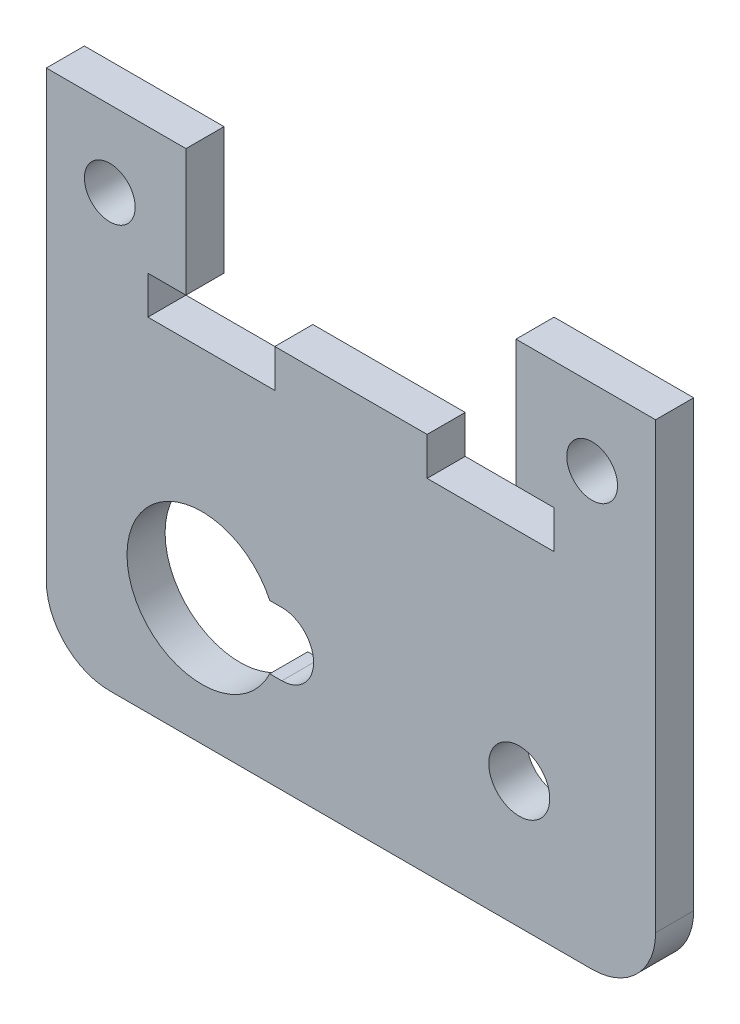
ISO-10303-21;
HEADER;
FILE_DESCRIPTION(('STEP AP214'),'2;1');
FILE_NAME('part.step','',(''),(''),'','','');
FILE_SCHEMA(('AUTOMOTIVE_DESIGN { 1 0 10303 214 1 1 1 1 }'));
ENDSEC;
DATA;
#1=APPLICATION_CONTEXT('core data for automotive mechanical design processes');
#2=APPLICATION_PROTOCOL_DEFINITION('international standard','automotive_design',2000,#1);
#3=PRODUCT_CONTEXT('',#1,'mechanical');
#4=PRODUCT('Part','Part','',(#3));
#5=PRODUCT_RELATED_PRODUCT_CATEGORY('part','',(#4));
#6=PRODUCT_DEFINITION_FORMATION('','',#4);
#7=PRODUCT_DEFINITION_CONTEXT('part definition',#1,'design');
#8=PRODUCT_DEFINITION('design','',#6,#7);
#9=PRODUCT_DEFINITION_SHAPE('','',#8);
#10=(LENGTH_UNIT() NAMED_UNIT(*) SI_UNIT(.MILLI.,.METRE.));
#11=(NAMED_UNIT(*) PLANE_ANGLE_UNIT() SI_UNIT($,.RADIAN.));
#12=(NAMED_UNIT(*) SI_UNIT($,.STERADIAN.) SOLID_ANGLE_UNIT());
#13=UNCERTAINTY_MEASURE_WITH_UNIT(LENGTH_MEASURE(1.E-05),#10,'distance_accuracy_value','');
#14=(GEOMETRIC_REPRESENTATION_CONTEXT(3) GLOBAL_UNCERTAINTY_ASSIGNED_CONTEXT((#13)) GLOBAL_UNIT_ASSIGNED_CONTEXT((#10,
#11,#12)) REPRESENTATION_CONTEXT('',''));
#15=CARTESIAN_POINT('',(0.,0.,0.));
#16=DIRECTION('',(0.,0.,1.));
#17=DIRECTION('',(1.,0.,0.));
#18=AXIS2_PLACEMENT_3D('',#15,#16,#17);
#19=CARTESIAN_POINT('',(103.12803142414,8.8100844335333,3.));
#20=DIRECTION('',(0.,0.,1.));
#21=DIRECTION('',(1.,0.,0.));
#22=AXIS2_PLACEMENT_3D('',#19,#20,#21);
#23=PLANE('',#22);
#24=CARTESIAN_POINT('',(65.1280314241405,37.8100844335333,3.));
#25=DIRECTION('',(0.,0.,1.));
#26=DIRECTION('',(1.,0.,0.));
#27=AXIS2_PLACEMENT_3D('',#24,#25,#26);
#28=CIRCLE('',#27,2.);
#29=CARTESIAN_POINT('',(67.1280314241405,37.8100844335333,3.));
#30=VERTEX_POINT('',#29);
#31=EDGE_CURVE('E224',#30,#30,#28,.T.);
#32=ORIENTED_EDGE('',*,*,#31,.F.);
#33=EDGE_LOOP('',(#32));
#34=FACE_BOUND('',#33,.T.);
#35=CARTESIAN_POINT('',(103.12803142414,8.8100844335333,3.));
#36=DIRECTION('',(0.,0.,1.));
#37=DIRECTION('',(1.,0.,0.));
#38=AXIS2_PLACEMENT_3D('',#35,#36,#37);
#39=CIRCLE('',#38,5.);
#40=CARTESIAN_POINT('',(103.12803142414,3.8100844335333,3.));
#41=VERTEX_POINT('',#40);
#42=CARTESIAN_POINT('',(108.12803142414,8.8100844335333,3.));
#43=VERTEX_POINT('',#42);
#44=EDGE_CURVE('E236',#41,#43,#39,.T.);
#45=ORIENTED_EDGE('',*,*,#44,.T.);
#46=DIRECTION('',(0.,1.,0.));
#47=VECTOR('',#46,1.);
#48=CARTESIAN_POINT('',(108.12803142414,8.8100844335333,3.));
#49=LINE('',#48,#47);
#50=CARTESIAN_POINT('',(108.12803142414,43.8100844335333,3.));
#51=VERTEX_POINT('',#50);
#52=EDGE_CURVE('E239',#43,#51,#49,.T.);
#53=ORIENTED_EDGE('',*,*,#52,.T.);
#54=DIRECTION('',(-1.,0.,0.));
#55=VECTOR('',#54,1.);
#56=CARTESIAN_POINT('',(108.12803142414,43.8100844335333,3.));
#57=LINE('',#56,#55);
#58=CARTESIAN_POINT('',(97.1280314241404,43.8100844335333,3.));
#59=VERTEX_POINT('',#58);
#60=EDGE_CURVE('E242',#51,#59,#57,.T.);
#61=ORIENTED_EDGE('',*,*,#60,.T.);
#62=DIRECTION('',(0.,-1.,0.));
#63=VECTOR('',#62,1.);
#64=CARTESIAN_POINT('',(97.1280314241404,43.8100844335333,3.));
#65=LINE('',#64,#63);
#66=CARTESIAN_POINT('',(97.1280314241404,33.8100844335333,3.));
#67=VERTEX_POINT('',#66);
#68=EDGE_CURVE('E244',#59,#67,#65,.T.);
#69=ORIENTED_EDGE('',*,*,#68,.T.);
#70=DIRECTION('',(1.,0.,0.));
#71=VECTOR('',#70,1.);
#72=CARTESIAN_POINT('',(97.1280314241404,33.8100844335333,3.));
#73=LINE('',#72,#71);
#74=CARTESIAN_POINT('',(100.12803142414,33.8100844335333,3.));
#75=VERTEX_POINT('',#74);
#76=EDGE_CURVE('E246',#67,#75,#73,.T.);
#77=ORIENTED_EDGE('',*,*,#76,.T.);
#78=DIRECTION('',(0.,-1.,0.));
#79=VECTOR('',#78,1.);
#80=CARTESIAN_POINT('',(100.12803142414,30.8100844335333,3.));
#81=LINE('',#80,#79);
#82=CARTESIAN_POINT('',(100.12803142414,30.8100844335333,3.));
#83=VERTEX_POINT('',#82);
#84=EDGE_CURVE('E248',#75,#83,#81,.T.);
#85=ORIENTED_EDGE('',*,*,#84,.T.);
#86=DIRECTION('',(-1.,0.,0.));
#87=VECTOR('',#86,1.);
#88=CARTESIAN_POINT('',(90.1280314241404,30.8100844335332,3.));
#89=LINE('',#88,#87);
#90=CARTESIAN_POINT('',(90.1280314241404,30.8100844335332,3.));
#91=VERTEX_POINT('',#90);
#92=EDGE_CURVE('E250',#83,#91,#89,.T.);
#93=ORIENTED_EDGE('',*,*,#92,.T.);
#94=DIRECTION('',(0.,1.,0.));
#95=VECTOR('',#94,1.);
#96=CARTESIAN_POINT('',(90.1280314241404,30.8100844335332,3.));
#97=LINE('',#96,#95);
#98=CARTESIAN_POINT('',(90.1280314241404,33.8100844335332,3.));
#99=VERTEX_POINT('',#98);
#100=EDGE_CURVE('E252',#91,#99,#97,.T.);
#101=ORIENTED_EDGE('',*,*,#100,.T.);
#102=DIRECTION('',(-1.,0.,0.));
#103=VECTOR('',#102,1.);
#104=CARTESIAN_POINT('',(78.1280314241404,33.8100844335333,3.));
#105=LINE('',#104,#103);
#106=CARTESIAN_POINT('',(78.1280314241404,33.8100844335333,3.));
#107=VERTEX_POINT('',#106);
#108=EDGE_CURVE('E254',#99,#107,#105,.T.);
#109=ORIENTED_EDGE('',*,*,#108,.T.);
#110=DIRECTION('',(0.,-1.,0.));
#111=VECTOR('',#110,1.);
#112=CARTESIAN_POINT('',(78.1280314241404,30.8100844335333,3.));
#113=LINE('',#112,#111);
#114=CARTESIAN_POINT('',(78.1280314241404,30.8100844335333,3.));
#115=VERTEX_POINT('',#114);
#116=EDGE_CURVE('E256',#107,#115,#113,.T.);
#117=ORIENTED_EDGE('',*,*,#116,.T.);
#118=DIRECTION('',(-1.,0.,0.));
#119=VECTOR('',#118,1.);
#120=CARTESIAN_POINT('',(78.1280314241404,30.8100844335333,3.));
#121=LINE('',#120,#119);
#122=CARTESIAN_POINT('',(68.1280314241404,30.8100844335333,3.));
#123=VERTEX_POINT('',#122);
#124=EDGE_CURVE('E258',#115,#123,#121,.T.);
#125=ORIENTED_EDGE('',*,*,#124,.T.);
#126=DIRECTION('',(0.,1.,0.));
#127=VECTOR('',#126,1.);
#128=CARTESIAN_POINT('',(68.1280314241404,33.8100844335333,3.));
#129=LINE('',#128,#127);
#130=CARTESIAN_POINT('',(68.1280314241404,33.8100844335333,3.));
#131=VERTEX_POINT('',#130);
#132=EDGE_CURVE('E260',#123,#131,#129,.T.);
#133=ORIENTED_EDGE('',*,*,#132,.T.);
#134=DIRECTION('',(1.,0.,0.));
#135=VECTOR('',#134,1.);
#136=CARTESIAN_POINT('',(71.1280314241404,33.8100844335333,3.));
#137=LINE('',#136,#135);
#138=CARTESIAN_POINT('',(71.1280314241404,33.8100844335333,3.));
#139=VERTEX_POINT('',#138);
#140=EDGE_CURVE('E262',#131,#139,#137,.T.);
#141=ORIENTED_EDGE('',*,*,#140,.T.);
#142=DIRECTION('',(0.,1.,0.));
#143=VECTOR('',#142,1.);
#144=CARTESIAN_POINT('',(71.1280314241404,33.8100844335333,3.));
#145=LINE('',#144,#143);
#146=CARTESIAN_POINT('',(71.1280314241404,43.8100844335333,3.));
#147=VERTEX_POINT('',#146);
#148=EDGE_CURVE('E264',#139,#147,#145,.T.);
#149=ORIENTED_EDGE('',*,*,#148,.T.);
#150=DIRECTION('',(-1.,0.,0.));
#151=VECTOR('',#150,1.);
#152=CARTESIAN_POINT('',(71.1280314241404,43.8100844335333,3.));
#153=LINE('',#152,#151);
#154=CARTESIAN_POINT('',(60.1280314241404,43.8100844335333,3.));
#155=VERTEX_POINT('',#154);
#156=EDGE_CURVE('E266',#147,#155,#153,.T.);
#157=ORIENTED_EDGE('',*,*,#156,.T.);
#158=DIRECTION('',(0.,-1.,0.));
#159=VECTOR('',#158,1.);
#160=CARTESIAN_POINT('',(60.1280314241404,43.8100844335333,3.));
#161=LINE('',#160,#159);
#162=CARTESIAN_POINT('',(60.1280314241404,8.81008443353327,3.));
#163=VERTEX_POINT('',#162);
#164=EDGE_CURVE('E268',#155,#163,#161,.T.);
#165=ORIENTED_EDGE('',*,*,#164,.T.);
#166=CARTESIAN_POINT('',(65.1280314241404,8.81008443353327,3.));
#167=DIRECTION('',(0.,0.,1.));
#168=DIRECTION('',(1.,0.,0.));
#169=AXIS2_PLACEMENT_3D('',#166,#167,#168);
#170=CIRCLE('',#169,5.);
#171=CARTESIAN_POINT('',(65.1280314241404,3.81008443353327,3.));
#172=VERTEX_POINT('',#171);
#173=EDGE_CURVE('E270',#163,#172,#170,.T.);
#174=ORIENTED_EDGE('',*,*,#173,.T.);
#175=DIRECTION('',(1.,0.,0.));
#176=VECTOR('',#175,1.);
#177=CARTESIAN_POINT('',(103.12803142414,3.8100844335333,3.));
#178=LINE('',#177,#176);
#179=EDGE_CURVE('E272',#172,#41,#178,.T.);
#180=ORIENTED_EDGE('',*,*,#179,.T.);
#181=EDGE_LOOP('',(#45,#53,#61,#69,#77,#85,#93,#101,#109,#117,#125,#133,#141,#149,#157,#165,
#174,#180));
#182=FACE_BOUND('',#181,.T.);
#183=CARTESIAN_POINT('',(97.3860855886078,13.7890327724979,3.));
#184=DIRECTION('',(0.,0.,1.));
#185=DIRECTION('',(1.,0.,0.));
#186=AXIS2_PLACEMENT_3D('',#183,#184,#185);
#187=CIRCLE('',#186,2.4);
#188=CARTESIAN_POINT('',(99.7860855886078,13.7890327724979,3.));
#189=VERTEX_POINT('',#188);
#190=EDGE_CURVE('E230',#189,#189,#187,.T.);
#191=ORIENTED_EDGE('',*,*,#190,.F.);
#192=EDGE_LOOP('',(#191));
#193=FACE_BOUND('',#192,.T.);
#194=CARTESIAN_POINT('',(103.12803142414,37.8100844335333,3.));
#195=DIRECTION('',(0.,0.,1.));
#196=DIRECTION('',(1.,0.,0.));
#197=AXIS2_PLACEMENT_3D('',#194,#195,#196);
#198=CIRCLE('',#197,2.);
#199=CARTESIAN_POINT('',(105.12803142414,37.8100844335333,3.));
#200=VERTEX_POINT('',#199);
#201=EDGE_CURVE('E218',#200,#200,#198,.T.);
#202=ORIENTED_EDGE('',*,*,#201,.F.);
#203=EDGE_LOOP('',(#202));
#204=FACE_BOUND('',#203,.T.);
#205=DIRECTION('',(-1.,5.96083041146063E-13,0.));
#206=VECTOR('',#205,1.);
#207=CARTESIAN_POINT('',(78.6834814891822,16.2779847681095,3.));
#208=LINE('',#207,#206);
#209=CARTESIAN_POINT('',(78.6834814891822,16.2779847681095,3.));
#210=VERTEX_POINT('',#209);
#211=CARTESIAN_POINT('',(77.7289344532081,16.2779847681101,3.));
#212=VERTEX_POINT('',#211);
#213=EDGE_CURVE('E190',#210,#212,#208,.T.);
#214=ORIENTED_EDGE('',*,*,#213,.F.);
#215=CARTESIAN_POINT('',(78.6834814891822,13.7779847681097,3.));
#216=DIRECTION('',(0.,0.,1.));
#217=DIRECTION('',(1.,0.,0.));
#218=AXIS2_PLACEMENT_3D('',#215,#216,#217);
#219=CIRCLE('',#218,2.49999999999983);
#220=CARTESIAN_POINT('',(78.6834814891822,11.2779847681098,3.));
#221=VERTEX_POINT('',#220);
#222=EDGE_CURVE('E182',#221,#210,#219,.T.);
#223=ORIENTED_EDGE('',*,*,#222,.F.);
#224=DIRECTION('',(1.,0.,0.));
#225=VECTOR('',#224,1.);
#226=CARTESIAN_POINT('',(78.6834814891822,11.2779847681098,3.));
#227=LINE('',#226,#225);
#228=CARTESIAN_POINT('',(77.7263350497494,11.2779847681098,3.));
#229=VERTEX_POINT('',#228);
#230=EDGE_CURVE('E204',#229,#221,#227,.T.);
#231=ORIENTED_EDGE('',*,*,#230,.F.);
#232=CARTESIAN_POINT('',(72.3834799453661,13.7807630910073,3.));
#233=DIRECTION('',(0.,0.,1.));
#234=DIRECTION('',(1.,0.,0.));
#235=AXIS2_PLACEMENT_3D('',#232,#233,#234);
#236=CIRCLE('',#235,5.89999999999998);
#237=EDGE_CURVE('E202',#212,#229,#236,.T.);
#238=ORIENTED_EDGE('',*,*,#237,.F.);
#239=EDGE_LOOP('',(#214,#223,#231,#238));
#240=FACE_BOUND('',#239,.T.);
#241=ADVANCED_FACE('F33',(#34,#182,#193,#204,#240),#23,.T.);
#242=CARTESIAN_POINT('',(103.12803142414,8.8100844335333,0.));
#243=DIRECTION('',(0.,0.,1.));
#244=DIRECTION('',(1.,0.,0.));
#245=AXIS2_PLACEMENT_3D('',#242,#243,#244);
#246=PLANE('',#245);
#247=CARTESIAN_POINT('',(103.12803142414,37.8100844335333,0.));
#248=DIRECTION('',(0.,0.,1.));
#249=DIRECTION('',(1.,0.,0.));
#250=AXIS2_PLACEMENT_3D('',#247,#248,#249);
#251=CIRCLE('',#250,2.);
#252=CARTESIAN_POINT('',(105.12803142414,37.8100844335333,0.));
#253=VERTEX_POINT('',#252);
#254=EDGE_CURVE('E198',#253,#253,#251,.T.);
#255=ORIENTED_EDGE('',*,*,#254,.T.);
#256=EDGE_LOOP('',(#255));
#257=FACE_BOUND('',#256,.T.);
#258=CARTESIAN_POINT('',(65.1280314241405,37.8100844335333,0.));
#259=DIRECTION('',(0.,0.,1.));
#260=DIRECTION('',(1.,0.,0.));
#261=AXIS2_PLACEMENT_3D('',#258,#259,#260);
#262=CIRCLE('',#261,2.);
#263=CARTESIAN_POINT('',(67.1280314241405,37.8100844335333,0.));
#264=VERTEX_POINT('',#263);
#265=EDGE_CURVE('E221',#264,#264,#262,.T.);
#266=ORIENTED_EDGE('',*,*,#265,.T.);
#267=EDGE_LOOP('',(#266));
#268=FACE_BOUND('',#267,.T.);
#269=CARTESIAN_POINT('',(97.3860855886078,13.7890327724979,0.));
#270=DIRECTION('',(0.,0.,1.));
#271=DIRECTION('',(1.,0.,0.));
#272=AXIS2_PLACEMENT_3D('',#269,#270,#271);
#273=CIRCLE('',#272,2.4);
#274=CARTESIAN_POINT('',(99.7860855886078,13.7890327724979,0.));
#275=VERTEX_POINT('',#274);
#276=EDGE_CURVE('E227',#275,#275,#273,.T.);
#277=ORIENTED_EDGE('',*,*,#276,.T.);
#278=EDGE_LOOP('',(#277));
#279=FACE_BOUND('',#278,.T.);
#280=CARTESIAN_POINT('',(103.12803142414,8.8100844335333,0.));
#281=DIRECTION('',(0.,0.,1.));
#282=DIRECTION('',(1.,0.,0.));
#283=AXIS2_PLACEMENT_3D('',#280,#281,#282);
#284=CIRCLE('',#283,5.);
#285=CARTESIAN_POINT('',(103.12803142414,3.8100844335333,0.));
#286=VERTEX_POINT('',#285);
#287=CARTESIAN_POINT('',(108.12803142414,8.8100844335333,0.));
#288=VERTEX_POINT('',#287);
#289=EDGE_CURVE('E233',#286,#288,#284,.T.);
#290=ORIENTED_EDGE('',*,*,#289,.F.);
#291=DIRECTION('',(1.,0.,0.));
#292=VECTOR('',#291,1.);
#293=CARTESIAN_POINT('',(103.12803142414,3.8100844335333,0.));
#294=LINE('',#293,#292);
#295=CARTESIAN_POINT('',(65.1280314241404,3.81008443353327,0.));
#296=VERTEX_POINT('',#295);
#297=EDGE_CURVE('E240',#296,#286,#294,.T.);
#298=ORIENTED_EDGE('',*,*,#297,.F.);
#299=CARTESIAN_POINT('',(65.1280314241404,8.81008443353327,0.));
#300=DIRECTION('',(0.,0.,1.));
#301=DIRECTION('',(1.,0.,0.));
#302=AXIS2_PLACEMENT_3D('',#299,#300,#301);
#303=CIRCLE('',#302,5.);
#304=CARTESIAN_POINT('',(60.1280314241404,8.81008443353327,0.));
#305=VERTEX_POINT('',#304);
#306=EDGE_CURVE('E308',#305,#296,#303,.T.);
#307=ORIENTED_EDGE('',*,*,#306,.F.);
#308=DIRECTION('',(0.,-1.,0.));
#309=VECTOR('',#308,1.);
#310=CARTESIAN_POINT('',(60.1280314241404,26.9884298120024,0.));
#311=LINE('',#310,#309);
#312=CARTESIAN_POINT('',(60.1280314241404,43.8100844335333,0.));
#313=VERTEX_POINT('',#312);
#314=EDGE_CURVE('E306',#313,#305,#311,.T.);
#315=ORIENTED_EDGE('',*,*,#314,.F.);
#316=DIRECTION('',(-1.,0.,0.));
#317=VECTOR('',#316,1.);
#318=CARTESIAN_POINT('',(71.1280314241404,43.8100844335333,0.));
#319=LINE('',#318,#317);
#320=CARTESIAN_POINT('',(71.1280314241404,43.8100844335333,0.));
#321=VERTEX_POINT('',#320);
#322=EDGE_CURVE('E303',#321,#313,#319,.T.);
#323=ORIENTED_EDGE('',*,*,#322,.F.);
#324=DIRECTION('',(0.,1.,0.));
#325=VECTOR('',#324,1.);
#326=CARTESIAN_POINT('',(71.1280314241404,33.8100844335333,0.));
#327=LINE('',#326,#325);
#328=CARTESIAN_POINT('',(71.1280314241404,33.8100844335333,0.));
#329=VERTEX_POINT('',#328);
#330=EDGE_CURVE('E301',#329,#321,#327,.T.);
#331=ORIENTED_EDGE('',*,*,#330,.F.);
#332=DIRECTION('',(1.,0.,0.));
#333=VECTOR('',#332,1.);
#334=CARTESIAN_POINT('',(71.1280314241404,33.8100844335333,0.));
#335=LINE('',#334,#333);
#336=CARTESIAN_POINT('',(68.1280314241404,33.8100844335333,0.));
#337=VERTEX_POINT('',#336);
#338=EDGE_CURVE('E299',#337,#329,#335,.T.);
#339=ORIENTED_EDGE('',*,*,#338,.F.);
#340=DIRECTION('',(0.,1.,0.));
#341=VECTOR('',#340,1.);
#342=CARTESIAN_POINT('',(68.1280314241404,33.8100844335333,0.));
#343=LINE('',#342,#341);
#344=CARTESIAN_POINT('',(68.1280314241404,30.8100844335333,0.));
#345=VERTEX_POINT('',#344);
#346=EDGE_CURVE('E297',#345,#337,#343,.T.);
#347=ORIENTED_EDGE('',*,*,#346,.F.);
#348=DIRECTION('',(-1.,0.,0.));
#349=VECTOR('',#348,1.);
#350=CARTESIAN_POINT('',(78.1280314241404,30.8100844335333,0.));
#351=LINE('',#350,#349);
#352=CARTESIAN_POINT('',(78.1280314241404,30.8100844335333,0.));
#353=VERTEX_POINT('',#352);
#354=EDGE_CURVE('E295',#353,#345,#351,.T.);
#355=ORIENTED_EDGE('',*,*,#354,.F.);
#356=DIRECTION('',(0.,-1.,0.));
#357=VECTOR('',#356,1.);
#358=CARTESIAN_POINT('',(78.1280314241404,30.8100844335333,0.));
#359=LINE('',#358,#357);
#360=CARTESIAN_POINT('',(78.1280314241404,33.8100844335333,0.));
#361=VERTEX_POINT('',#360);
#362=EDGE_CURVE('E293',#361,#353,#359,.T.);
#363=ORIENTED_EDGE('',*,*,#362,.F.);
#364=DIRECTION('',(-1.,0.,0.));
#365=VECTOR('',#364,1.);
#366=CARTESIAN_POINT('',(78.1280314241404,33.8100844335333,0.));
#367=LINE('',#366,#365);
#368=CARTESIAN_POINT('',(90.1280314241404,33.8100844335332,0.));
#369=VERTEX_POINT('',#368);
#370=EDGE_CURVE('E291',#369,#361,#367,.T.);
#371=ORIENTED_EDGE('',*,*,#370,.F.);
#372=DIRECTION('',(0.,1.,0.));
#373=VECTOR('',#372,1.);
#374=CARTESIAN_POINT('',(90.1280314241404,30.8100844335332,0.));
#375=LINE('',#374,#373);
#376=CARTESIAN_POINT('',(90.1280314241404,30.8100844335332,0.));
#377=VERTEX_POINT('',#376);
#378=EDGE_CURVE('E289',#377,#369,#375,.T.);
#379=ORIENTED_EDGE('',*,*,#378,.F.);
#380=DIRECTION('',(-1.,0.,0.));
#381=VECTOR('',#380,1.);
#382=CARTESIAN_POINT('',(90.1280314241404,30.8100844335332,0.));
#383=LINE('',#382,#381);
#384=CARTESIAN_POINT('',(100.12803142414,30.8100844335333,0.));
#385=VERTEX_POINT('',#384);
#386=EDGE_CURVE('E287',#385,#377,#383,.T.);
#387=ORIENTED_EDGE('',*,*,#386,.F.);
#388=DIRECTION('',(0.,-1.,0.));
#389=VECTOR('',#388,1.);
#390=CARTESIAN_POINT('',(100.12803142414,30.8100844335333,0.));
#391=LINE('',#390,#389);
#392=CARTESIAN_POINT('',(100.12803142414,33.8100844335333,0.));
#393=VERTEX_POINT('',#392);
#394=EDGE_CURVE('E285',#393,#385,#391,.T.);
#395=ORIENTED_EDGE('',*,*,#394,.F.);
#396=DIRECTION('',(1.,0.,0.));
#397=VECTOR('',#396,1.);
#398=CARTESIAN_POINT('',(97.1280314241404,33.8100844335333,0.));
#399=LINE('',#398,#397);
#400=CARTESIAN_POINT('',(97.1280314241404,33.8100844335333,0.));
#401=VERTEX_POINT('',#400);
#402=EDGE_CURVE('E283',#401,#393,#399,.T.);
#403=ORIENTED_EDGE('',*,*,#402,.F.);
#404=DIRECTION('',(0.,-1.,0.));
#405=VECTOR('',#404,1.);
#406=CARTESIAN_POINT('',(97.1280314241404,43.8100844335333,0.));
#407=LINE('',#406,#405);
#408=CARTESIAN_POINT('',(97.1280314241404,43.8100844335333,0.));
#409=VERTEX_POINT('',#408);
#410=EDGE_CURVE('E281',#409,#401,#407,.T.);
#411=ORIENTED_EDGE('',*,*,#410,.F.);
#412=DIRECTION('',(-1.,0.,0.));
#413=VECTOR('',#412,1.);
#414=CARTESIAN_POINT('',(108.12803142414,43.8100844335333,0.));
#415=LINE('',#414,#413);
#416=CARTESIAN_POINT('',(108.12803142414,43.8100844335333,0.));
#417=VERTEX_POINT('',#416);
#418=EDGE_CURVE('E279',#417,#409,#415,.T.);
#419=ORIENTED_EDGE('',*,*,#418,.F.);
#420=DIRECTION('',(0.,1.,0.));
#421=VECTOR('',#420,1.);
#422=CARTESIAN_POINT('',(108.12803142414,8.8100844335333,0.));
#423=LINE('',#422,#421);
#424=EDGE_CURVE('E277',#288,#417,#423,.T.);
#425=ORIENTED_EDGE('',*,*,#424,.F.);
#426=EDGE_LOOP('',(#290,#298,#307,#315,#323,#331,#339,#347,#355,#363,#371,#379,#387,#395,#403,
#411,#419,#425));
#427=FACE_BOUND('',#426,.T.);
#428=CARTESIAN_POINT('',(78.6834814891822,13.7779847681097,0.));
#429=DIRECTION('',(0.,0.,1.));
#430=DIRECTION('',(1.,0.,0.));
#431=AXIS2_PLACEMENT_3D('',#428,#429,#430);
#432=CIRCLE('',#431,2.49999999999983);
#433=CARTESIAN_POINT('',(78.6834814891822,11.2779847681098,0.));
#434=VERTEX_POINT('',#433);
#435=CARTESIAN_POINT('',(78.6834814891822,16.2779847681095,0.));
#436=VERTEX_POINT('',#435);
#437=EDGE_CURVE('E56',#434,#436,#432,.T.);
#438=ORIENTED_EDGE('',*,*,#437,.T.);
#439=DIRECTION('',(-1.,5.96083041146063E-13,0.));
#440=VECTOR('',#439,1.);
#441=CARTESIAN_POINT('',(78.6834814891822,16.2779847681095,0.));
#442=LINE('',#441,#440);
#443=CARTESIAN_POINT('',(77.7289344532081,16.2779847681101,0.));
#444=VERTEX_POINT('',#443);
#445=EDGE_CURVE('E197',#436,#444,#442,.T.);
#446=ORIENTED_EDGE('',*,*,#445,.T.);
#447=CARTESIAN_POINT('',(72.3834799453661,13.7807630910073,0.));
#448=DIRECTION('',(0.,0.,1.));
#449=DIRECTION('',(1.,0.,0.));
#450=AXIS2_PLACEMENT_3D('',#447,#448,#449);
#451=CIRCLE('',#450,5.89999999999998);
#452=CARTESIAN_POINT('',(77.7263350497494,11.2779847681098,0.));
#453=VERTEX_POINT('',#452);
#454=EDGE_CURVE('E210',#444,#453,#451,.T.);
#455=ORIENTED_EDGE('',*,*,#454,.T.);
#456=DIRECTION('',(1.,0.,0.));
#457=VECTOR('',#456,1.);
#458=CARTESIAN_POINT('',(78.6834814891822,11.2779847681098,0.));
#459=LINE('',#458,#457);
#460=EDGE_CURVE('E191',#453,#434,#459,.T.);
#461=ORIENTED_EDGE('',*,*,#460,.T.);
#462=EDGE_LOOP('',(#438,#446,#455,#461));
#463=FACE_BOUND('',#462,.T.);
#464=ADVANCED_FACE('F368',(#257,#268,#279,#427,#463),#246,.F.);
#465=CARTESIAN_POINT('',(103.12803142414,8.8100844335333,3.));
#466=DIRECTION('',(0.,0.,-1.));
#467=DIRECTION('',(-1.,0.,0.));
#468=AXIS2_PLACEMENT_3D('',#465,#466,#467);
#469=CYLINDRICAL_SURFACE('',#468,5.);
#470=ORIENTED_EDGE('',*,*,#289,.T.);
#471=DIRECTION('',(0.,0.,-1.));
#472=VECTOR('',#471,1.);
#473=CARTESIAN_POINT('',(108.12803142414,8.8100844335333,3.));
#474=LINE('',#473,#472);
#475=EDGE_CURVE('E11',#43,#288,#474,.T.);
#476=ORIENTED_EDGE('',*,*,#475,.F.);
#477=ORIENTED_EDGE('',*,*,#44,.F.);
#478=DIRECTION('',(0.,0.,-1.));
#479=VECTOR('',#478,1.);
#480=CARTESIAN_POINT('',(103.12803142414,3.8100844335333,3.));
#481=LINE('',#480,#479);
#482=EDGE_CURVE('E274',#41,#286,#481,.T.);
#483=ORIENTED_EDGE('',*,*,#482,.T.);
#484=EDGE_LOOP('',(#470,#476,#477,#483));
#485=FACE_BOUND('',#484,.T.);
#486=ADVANCED_FACE('F35',(#485),#469,.T.);
#487=CARTESIAN_POINT('',(108.12803142414,8.8100844335333,3.));
#488=DIRECTION('',(-1.,0.,0.));
#489=DIRECTION('',(0.,-1.,0.));
#490=AXIS2_PLACEMENT_3D('',#487,#488,#489);
#491=PLANE('',#490);
#492=ORIENTED_EDGE('',*,*,#424,.T.);
#493=DIRECTION('',(0.,0.,-1.));
#494=VECTOR('',#493,1.);
#495=CARTESIAN_POINT('',(108.12803142414,43.8100844335333,3.));
#496=LINE('',#495,#494);
#497=EDGE_CURVE('E41',#51,#417,#496,.T.);
#498=ORIENTED_EDGE('',*,*,#497,.F.);
#499=ORIENTED_EDGE('',*,*,#52,.F.);
#500=ORIENTED_EDGE('',*,*,#475,.T.);
#501=EDGE_LOOP('',(#492,#498,#499,#500));
#502=FACE_BOUND('',#501,.T.);
#503=ADVANCED_FACE('F386',(#502),#491,.F.);
#504=CARTESIAN_POINT('',(108.12803142414,43.8100844335333,3.));
#505=DIRECTION('',(0.,-1.,0.));
#506=DIRECTION('',(0.,0.,-1.));
#507=AXIS2_PLACEMENT_3D('',#504,#505,#506);
#508=PLANE('',#507);
#509=ORIENTED_EDGE('',*,*,#418,.T.);
#510=DIRECTION('',(0.,0.,-1.));
#511=VECTOR('',#510,1.);
#512=CARTESIAN_POINT('',(97.1280314241404,43.8100844335333,3.));
#513=LINE('',#512,#511);
#514=EDGE_CURVE('E355',#59,#409,#513,.T.);
#515=ORIENTED_EDGE('',*,*,#514,.F.);
#516=ORIENTED_EDGE('',*,*,#60,.F.);
#517=ORIENTED_EDGE('',*,*,#497,.T.);
#518=EDGE_LOOP('',(#509,#515,#516,#517));
#519=FACE_BOUND('',#518,.T.);
#520=ADVANCED_FACE('F362',(#519),#508,.F.);
#521=CARTESIAN_POINT('',(97.1280314241404,43.8100844335333,3.));
#522=DIRECTION('',(1.,0.,0.));
#523=DIRECTION('',(0.,0.,-1.));
#524=AXIS2_PLACEMENT_3D('',#521,#522,#523);
#525=PLANE('',#524);
#526=ORIENTED_EDGE('',*,*,#410,.T.);
#527=DIRECTION('',(0.,0.,-1.));
#528=VECTOR('',#527,1.);
#529=CARTESIAN_POINT('',(97.1280314241404,33.8100844335333,3.));
#530=LINE('',#529,#528);
#531=EDGE_CURVE('E352',#67,#401,#530,.T.);
#532=ORIENTED_EDGE('',*,*,#531,.F.);
#533=ORIENTED_EDGE('',*,*,#68,.F.);
#534=ORIENTED_EDGE('',*,*,#514,.T.);
#535=EDGE_LOOP('',(#526,#532,#533,#534));
#536=FACE_BOUND('',#535,.T.);
#537=ADVANCED_FACE('F374',(#536),#525,.F.);
#538=CARTESIAN_POINT('',(97.1280314241404,33.8100844335333,3.));
#539=DIRECTION('',(0.,1.,0.));
#540=DIRECTION('',(0.,0.,1.));
#541=AXIS2_PLACEMENT_3D('',#538,#539,#540);
#542=PLANE('',#541);
#543=ORIENTED_EDGE('',*,*,#402,.T.);
#544=DIRECTION('',(0.,0.,-1.));
#545=VECTOR('',#544,1.);
#546=CARTESIAN_POINT('',(100.12803142414,33.8100844335333,3.));
#547=LINE('',#546,#545);
#548=EDGE_CURVE('E349',#75,#393,#547,.T.);
#549=ORIENTED_EDGE('',*,*,#548,.F.);
#550=ORIENTED_EDGE('',*,*,#76,.F.);
#551=ORIENTED_EDGE('',*,*,#531,.T.);
#552=EDGE_LOOP('',(#543,#549,#550,#551));
#553=FACE_BOUND('',#552,.T.);
#554=ADVANCED_FACE('F378',(#553),#542,.F.);
#555=CARTESIAN_POINT('',(100.12803142414,30.8100844335333,3.));
#556=DIRECTION('',(1.,0.,0.));
#557=DIRECTION('',(0.,0.,-1.));
#558=AXIS2_PLACEMENT_3D('',#555,#556,#557);
#559=PLANE('',#558);
#560=ORIENTED_EDGE('',*,*,#394,.T.);
#561=DIRECTION('',(0.,0.,-1.));
#562=VECTOR('',#561,1.);
#563=CARTESIAN_POINT('',(100.12803142414,30.8100844335333,3.));
#564=LINE('',#563,#562);
#565=EDGE_CURVE('E346',#83,#385,#564,.T.);
#566=ORIENTED_EDGE('',*,*,#565,.F.);
#567=ORIENTED_EDGE('',*,*,#84,.F.);
#568=ORIENTED_EDGE('',*,*,#548,.T.);
#569=EDGE_LOOP('',(#560,#566,#567,#568));
#570=FACE_BOUND('',#569,.T.);
#571=ADVANCED_FACE('F448',(#570),#559,.F.);
#572=CARTESIAN_POINT('',(90.1280314241404,30.8100844335332,3.));
#573=DIRECTION('',(0.,-1.,0.));
#574=DIRECTION('',(1.,0.,0.));
#575=AXIS2_PLACEMENT_3D('',#572,#573,#574);
#576=PLANE('',#575);
#577=ORIENTED_EDGE('',*,*,#386,.T.);
#578=DIRECTION('',(0.,0.,-1.));
#579=VECTOR('',#578,1.);
#580=CARTESIAN_POINT('',(90.1280314241404,30.8100844335332,3.));
#581=LINE('',#580,#579);
#582=EDGE_CURVE('E343',#91,#377,#581,.T.);
#583=ORIENTED_EDGE('',*,*,#582,.F.);
#584=ORIENTED_EDGE('',*,*,#92,.F.);
#585=ORIENTED_EDGE('',*,*,#565,.T.);
#586=EDGE_LOOP('',(#577,#583,#584,#585));
#587=FACE_BOUND('',#586,.T.);
#588=ADVANCED_FACE('F445',(#587),#576,.F.);
#589=CARTESIAN_POINT('',(90.1280314241404,30.8100844335332,3.));
#590=DIRECTION('',(-1.,0.,0.));
#591=DIRECTION('',(0.,0.,1.));
#592=AXIS2_PLACEMENT_3D('',#589,#590,#591);
#593=PLANE('',#592);
#594=ORIENTED_EDGE('',*,*,#378,.T.);
#595=DIRECTION('',(0.,0.,-1.));
#596=VECTOR('',#595,1.);
#597=CARTESIAN_POINT('',(90.1280314241404,33.8100844335332,3.));
#598=LINE('',#597,#596);
#599=EDGE_CURVE('E340',#99,#369,#598,.T.);
#600=ORIENTED_EDGE('',*,*,#599,.F.);
#601=ORIENTED_EDGE('',*,*,#100,.F.);
#602=ORIENTED_EDGE('',*,*,#582,.T.);
#603=EDGE_LOOP('',(#594,#600,#601,#602));
#604=FACE_BOUND('',#603,.T.);
#605=ADVANCED_FACE('F441',(#604),#593,.F.);
#606=CARTESIAN_POINT('',(78.1280314241404,33.8100844335333,3.));
#607=DIRECTION('',(0.,-1.,0.));
#608=DIRECTION('',(1.,0.,0.));
#609=AXIS2_PLACEMENT_3D('',#606,#607,#608);
#610=PLANE('',#609);
#611=ORIENTED_EDGE('',*,*,#370,.T.);
#612=DIRECTION('',(0.,0.,-1.));
#613=VECTOR('',#612,1.);
#614=CARTESIAN_POINT('',(78.1280314241404,33.8100844335333,3.));
#615=LINE('',#614,#613);
#616=EDGE_CURVE('E337',#107,#361,#615,.T.);
#617=ORIENTED_EDGE('',*,*,#616,.F.);
#618=ORIENTED_EDGE('',*,*,#108,.F.);
#619=ORIENTED_EDGE('',*,*,#599,.T.);
#620=EDGE_LOOP('',(#611,#617,#618,#619));
#621=FACE_BOUND('',#620,.T.);
#622=ADVANCED_FACE('F437',(#621),#610,.F.);
#623=CARTESIAN_POINT('',(78.1280314241404,30.8100844335333,3.));
#624=DIRECTION('',(1.,0.,0.));
#625=DIRECTION('',(0.,0.,-1.));
#626=AXIS2_PLACEMENT_3D('',#623,#624,#625);
#627=PLANE('',#626);
#628=ORIENTED_EDGE('',*,*,#362,.T.);
#629=DIRECTION('',(0.,0.,-1.));
#630=VECTOR('',#629,1.);
#631=CARTESIAN_POINT('',(78.1280314241404,30.8100844335333,3.));
#632=LINE('',#631,#630);
#633=EDGE_CURVE('E334',#115,#353,#632,.T.);
#634=ORIENTED_EDGE('',*,*,#633,.F.);
#635=ORIENTED_EDGE('',*,*,#116,.F.);
#636=ORIENTED_EDGE('',*,*,#616,.T.);
#637=EDGE_LOOP('',(#628,#634,#635,#636));
#638=FACE_BOUND('',#637,.T.);
#639=ADVANCED_FACE('F432',(#638),#627,.F.);
#640=CARTESIAN_POINT('',(78.1280314241404,30.8100844335333,3.));
#641=DIRECTION('',(0.,-1.,0.));
#642=DIRECTION('',(0.,0.,-1.));
#643=AXIS2_PLACEMENT_3D('',#640,#641,#642);
#644=PLANE('',#643);
#645=ORIENTED_EDGE('',*,*,#354,.T.);
#646=DIRECTION('',(0.,0.,-1.));
#647=VECTOR('',#646,1.);
#648=CARTESIAN_POINT('',(68.1280314241404,30.8100844335333,3.));
#649=LINE('',#648,#647);
#650=EDGE_CURVE('E331',#123,#345,#649,.T.);
#651=ORIENTED_EDGE('',*,*,#650,.F.);
#652=ORIENTED_EDGE('',*,*,#124,.F.);
#653=ORIENTED_EDGE('',*,*,#633,.T.);
#654=EDGE_LOOP('',(#645,#651,#652,#653));
#655=FACE_BOUND('',#654,.T.);
#656=ADVANCED_FACE('F426',(#655),#644,.F.);
#657=CARTESIAN_POINT('',(68.1280314241404,33.8100844335333,3.));
#658=DIRECTION('',(-1.,0.,0.));
#659=DIRECTION('',(0.,0.,1.));
#660=AXIS2_PLACEMENT_3D('',#657,#658,#659);
#661=PLANE('',#660);
#662=ORIENTED_EDGE('',*,*,#346,.T.);
#663=DIRECTION('',(0.,0.,-1.));
#664=VECTOR('',#663,1.);
#665=CARTESIAN_POINT('',(68.1280314241404,33.8100844335333,3.));
#666=LINE('',#665,#664);
#667=EDGE_CURVE('E328',#131,#337,#666,.T.);
#668=ORIENTED_EDGE('',*,*,#667,.F.);
#669=ORIENTED_EDGE('',*,*,#132,.F.);
#670=ORIENTED_EDGE('',*,*,#650,.T.);
#671=EDGE_LOOP('',(#662,#668,#669,#670));
#672=FACE_BOUND('',#671,.T.);
#673=ADVANCED_FACE('F422',(#672),#661,.F.);
#674=CARTESIAN_POINT('',(71.1280314241404,33.8100844335333,3.));
#675=DIRECTION('',(0.,1.,0.));
#676=DIRECTION('',(-1.,0.,0.));
#677=AXIS2_PLACEMENT_3D('',#674,#675,#676);
#678=PLANE('',#677);
#679=ORIENTED_EDGE('',*,*,#338,.T.);
#680=DIRECTION('',(0.,0.,-1.));
#681=VECTOR('',#680,1.);
#682=CARTESIAN_POINT('',(71.1280314241404,33.8100844335333,3.));
#683=LINE('',#682,#681);
#684=EDGE_CURVE('E325',#139,#329,#683,.T.);
#685=ORIENTED_EDGE('',*,*,#684,.F.);
#686=ORIENTED_EDGE('',*,*,#140,.F.);
#687=ORIENTED_EDGE('',*,*,#667,.T.);
#688=EDGE_LOOP('',(#679,#685,#686,#687));
#689=FACE_BOUND('',#688,.T.);
#690=ADVANCED_FACE('F417',(#689),#678,.F.);
#691=CARTESIAN_POINT('',(71.1280314241404,33.8100844335333,3.));
#692=DIRECTION('',(-1.,0.,0.));
#693=DIRECTION('',(0.,0.,1.));
#694=AXIS2_PLACEMENT_3D('',#691,#692,#693);
#695=PLANE('',#694);
#696=ORIENTED_EDGE('',*,*,#330,.T.);
#697=DIRECTION('',(0.,0.,-1.));
#698=VECTOR('',#697,1.);
#699=CARTESIAN_POINT('',(71.1280314241404,43.8100844335333,3.));
#700=LINE('',#699,#698);
#701=EDGE_CURVE('E322',#147,#321,#700,.T.);
#702=ORIENTED_EDGE('',*,*,#701,.F.);
#703=ORIENTED_EDGE('',*,*,#148,.F.);
#704=ORIENTED_EDGE('',*,*,#684,.T.);
#705=EDGE_LOOP('',(#696,#702,#703,#704));
#706=FACE_BOUND('',#705,.T.);
#707=ADVANCED_FACE('F411',(#706),#695,.F.);
#708=CARTESIAN_POINT('',(71.1280314241404,43.8100844335333,3.));
#709=DIRECTION('',(0.,-1.,0.));
#710=DIRECTION('',(0.,0.,-1.));
#711=AXIS2_PLACEMENT_3D('',#708,#709,#710);
#712=PLANE('',#711);
#713=ORIENTED_EDGE('',*,*,#322,.T.);
#714=DIRECTION('',(0.,0.,-1.));
#715=VECTOR('',#714,1.);
#716=CARTESIAN_POINT('',(60.1280314241404,43.8100844335333,3.));
#717=LINE('',#716,#715);
#718=EDGE_CURVE('E319',#155,#313,#717,.T.);
#719=ORIENTED_EDGE('',*,*,#718,.F.);
#720=ORIENTED_EDGE('',*,*,#156,.F.);
#721=ORIENTED_EDGE('',*,*,#701,.T.);
#722=EDGE_LOOP('',(#713,#719,#720,#721));
#723=FACE_BOUND('',#722,.T.);
#724=ADVANCED_FACE('F406',(#723),#712,.F.);
#725=CARTESIAN_POINT('',(60.1280314241404,26.9884298120024,3.));
#726=DIRECTION('',(1.,0.,0.));
#727=DIRECTION('',(0.,1.,0.));
#728=AXIS2_PLACEMENT_3D('',#725,#726,#727);
#729=PLANE('',#728);
#730=ORIENTED_EDGE('',*,*,#314,.T.);
#731=DIRECTION('',(0.,0.,-1.));
#732=VECTOR('',#731,1.);
#733=CARTESIAN_POINT('',(60.1280314241404,8.81008443353327,3.));
#734=LINE('',#733,#732);
#735=EDGE_CURVE('E316',#163,#305,#734,.T.);
#736=ORIENTED_EDGE('',*,*,#735,.F.);
#737=ORIENTED_EDGE('',*,*,#164,.F.);
#738=ORIENTED_EDGE('',*,*,#718,.T.);
#739=EDGE_LOOP('',(#730,#736,#737,#738));
#740=FACE_BOUND('',#739,.T.);
#741=ADVANCED_FACE('F401',(#740),#729,.F.);
#742=CARTESIAN_POINT('',(65.1280314241404,8.81008443353327,3.));
#743=DIRECTION('',(0.,0.,-1.));
#744=DIRECTION('',(-1.,0.,0.));
#745=AXIS2_PLACEMENT_3D('',#742,#743,#744);
#746=CYLINDRICAL_SURFACE('',#745,5.);
#747=ORIENTED_EDGE('',*,*,#306,.T.);
#748=DIRECTION('',(0.,0.,-1.));
#749=VECTOR('',#748,1.);
#750=CARTESIAN_POINT('',(65.1280314241404,3.81008443353327,3.));
#751=LINE('',#750,#749);
#752=EDGE_CURVE('E313',#172,#296,#751,.T.);
#753=ORIENTED_EDGE('',*,*,#752,.F.);
#754=ORIENTED_EDGE('',*,*,#173,.F.);
#755=ORIENTED_EDGE('',*,*,#735,.T.);
#756=EDGE_LOOP('',(#747,#753,#754,#755));
#757=FACE_BOUND('',#756,.T.);
#758=ADVANCED_FACE('F397',(#757),#746,.T.);
#759=CARTESIAN_POINT('',(103.12803142414,3.8100844335333,3.));
#760=DIRECTION('',(0.,1.,0.));
#761=DIRECTION('',(-1.,0.,0.));
#762=AXIS2_PLACEMENT_3D('',#759,#760,#761);
#763=PLANE('',#762);
#764=ORIENTED_EDGE('',*,*,#297,.T.);
#765=ORIENTED_EDGE('',*,*,#482,.F.);
#766=ORIENTED_EDGE('',*,*,#179,.F.);
#767=ORIENTED_EDGE('',*,*,#752,.T.);
#768=EDGE_LOOP('',(#764,#765,#766,#767));
#769=FACE_BOUND('',#768,.T.);
#770=ADVANCED_FACE('F392',(#769),#763,.F.);
#771=CARTESIAN_POINT('',(97.3860855886078,13.7890327724979,3.));
#772=DIRECTION('',(0.,0.,-1.));
#773=DIRECTION('',(-1.,0.,0.));
#774=AXIS2_PLACEMENT_3D('',#771,#772,#773);
#775=CYLINDRICAL_SURFACE('',#774,2.4);
#776=ORIENTED_EDGE('',*,*,#190,.T.);
#777=EDGE_LOOP('',(#776));
#778=FACE_BOUND('',#777,.T.);
#779=ORIENTED_EDGE('',*,*,#276,.F.);
#780=EDGE_LOOP('',(#779));
#781=FACE_BOUND('',#780,.T.);
#782=ADVANCED_FACE('F467',(#778,#781),#775,.F.);
#783=CARTESIAN_POINT('',(65.1280314241405,37.8100844335333,3.));
#784=DIRECTION('',(0.,0.,-1.));
#785=DIRECTION('',(-1.,0.,0.));
#786=AXIS2_PLACEMENT_3D('',#783,#784,#785);
#787=CYLINDRICAL_SURFACE('',#786,2.);
#788=ORIENTED_EDGE('',*,*,#31,.T.);
#789=EDGE_LOOP('',(#788));
#790=FACE_BOUND('',#789,.T.);
#791=ORIENTED_EDGE('',*,*,#265,.F.);
#792=EDGE_LOOP('',(#791));
#793=FACE_BOUND('',#792,.T.);
#794=ADVANCED_FACE('F541',(#790,#793),#787,.F.);
#795=CARTESIAN_POINT('',(103.12803142414,37.8100844335333,3.));
#796=DIRECTION('',(0.,0.,-1.));
#797=DIRECTION('',(-1.,0.,0.));
#798=AXIS2_PLACEMENT_3D('',#795,#796,#797);
#799=CYLINDRICAL_SURFACE('',#798,2.);
#800=ORIENTED_EDGE('',*,*,#201,.T.);
#801=EDGE_LOOP('',(#800));
#802=FACE_BOUND('',#801,.T.);
#803=ORIENTED_EDGE('',*,*,#254,.F.);
#804=EDGE_LOOP('',(#803));
#805=FACE_BOUND('',#804,.T.);
#806=ADVANCED_FACE('F548',(#802,#805),#799,.F.);
#807=CARTESIAN_POINT('',(78.6834814891822,13.7779847681097,3.));
#808=DIRECTION('',(0.,0.,-1.));
#809=DIRECTION('',(-1.,0.,0.));
#810=AXIS2_PLACEMENT_3D('',#807,#808,#809);
#811=CYLINDRICAL_SURFACE('',#810,2.49999999999983);
#812=ORIENTED_EDGE('',*,*,#437,.F.);
#813=DIRECTION('',(0.,0.,-1.));
#814=VECTOR('',#813,1.);
#815=CARTESIAN_POINT('',(78.6834814891822,11.2779847681098,3.));
#816=LINE('',#815,#814);
#817=EDGE_CURVE('E186',#221,#434,#816,.T.);
#818=ORIENTED_EDGE('',*,*,#817,.F.);
#819=ORIENTED_EDGE('',*,*,#222,.T.);
#820=DIRECTION('',(0.,0.,-1.));
#821=VECTOR('',#820,1.);
#822=CARTESIAN_POINT('',(78.6834814891822,16.2779847681095,3.));
#823=LINE('',#822,#821);
#824=EDGE_CURVE('E185',#210,#436,#823,.T.);
#825=ORIENTED_EDGE('',*,*,#824,.T.);
#826=EDGE_LOOP('',(#812,#818,#819,#825));
#827=FACE_BOUND('',#826,.T.);
#828=ADVANCED_FACE('F184',(#827),#811,.F.);
#829=CARTESIAN_POINT('',(78.6834814891822,16.2779847681095,3.));
#830=DIRECTION('',(-5.96083041146063E-13,-1.,0.));
#831=DIRECTION('',(1.,-5.96083041146063E-13,0.));
#832=AXIS2_PLACEMENT_3D('',#829,#830,#831);
#833=PLANE('',#832);
#834=ORIENTED_EDGE('',*,*,#445,.F.);
#835=ORIENTED_EDGE('',*,*,#824,.F.);
#836=ORIENTED_EDGE('',*,*,#213,.T.);
#837=DIRECTION('',(0.,0.,-1.));
#838=VECTOR('',#837,1.);
#839=CARTESIAN_POINT('',(77.7289344532081,16.2779847681101,3.));
#840=LINE('',#839,#838);
#841=EDGE_CURVE('E199',#212,#444,#840,.T.);
#842=ORIENTED_EDGE('',*,*,#841,.T.);
#843=EDGE_LOOP('',(#834,#835,#836,#842));
#844=FACE_BOUND('',#843,.T.);
#845=ADVANCED_FACE('F194',(#844),#833,.T.);
#846=CARTESIAN_POINT('',(72.3834799453661,13.7807630910073,3.));
#847=DIRECTION('',(0.,0.,-1.));
#848=DIRECTION('',(-1.,0.,0.));
#849=AXIS2_PLACEMENT_3D('',#846,#847,#848);
#850=CYLINDRICAL_SURFACE('',#849,5.89999999999998);
#851=ORIENTED_EDGE('',*,*,#454,.F.);
#852=ORIENTED_EDGE('',*,*,#841,.F.);
#853=ORIENTED_EDGE('',*,*,#237,.T.);
#854=DIRECTION('',(0.,0.,-1.));
#855=VECTOR('',#854,1.);
#856=CARTESIAN_POINT('',(77.7263350497494,11.2779847681098,3.));
#857=LINE('',#856,#855);
#858=EDGE_CURVE('E48',#229,#453,#857,.T.);
#859=ORIENTED_EDGE('',*,*,#858,.T.);
#860=EDGE_LOOP('',(#851,#852,#853,#859));
#861=FACE_BOUND('',#860,.T.);
#862=ADVANCED_FACE('F568',(#861),#850,.F.);
#863=CARTESIAN_POINT('',(78.6834814891822,11.2779847681098,3.));
#864=DIRECTION('',(0.,1.,0.));
#865=DIRECTION('',(0.,0.,1.));
#866=AXIS2_PLACEMENT_3D('',#863,#864,#865);
#867=PLANE('',#866);
#868=ORIENTED_EDGE('',*,*,#460,.F.);
#869=ORIENTED_EDGE('',*,*,#858,.F.);
#870=ORIENTED_EDGE('',*,*,#230,.T.);
#871=ORIENTED_EDGE('',*,*,#817,.T.);
#872=EDGE_LOOP('',(#868,#869,#870,#871));
#873=FACE_BOUND('',#872,.T.);
#874=ADVANCED_FACE('F575',(#873),#867,.T.);
#875=CLOSED_SHELL('',(#241,#464,#486,#503,#520,#537,#554,#571,#588,#605,#622,#639,#656,#673,
#690,#707,#724,#741,#758,#770,#782,#794,#806,#828,#845,#862,#874));
#876=MANIFOLD_SOLID_BREP('B2',#875);
#877=ADVANCED_BREP_SHAPE_REPRESENTATION('',(#18,#876),#14);
#878=SHAPE_DEFINITION_REPRESENTATION(#9,#877);
ENDSEC;
END-ISO-10303-21;
